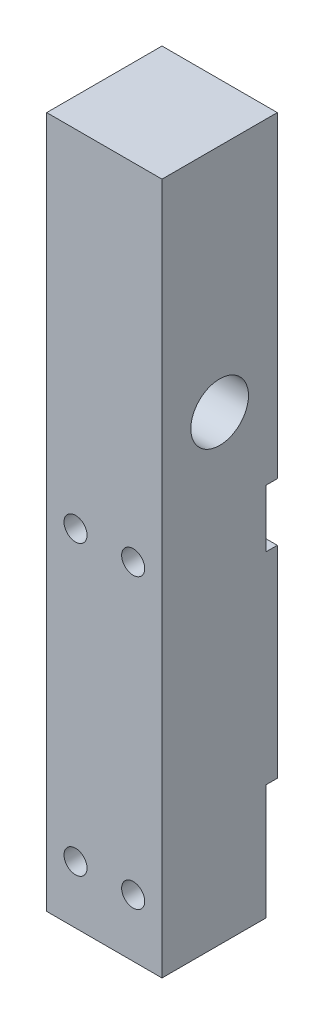
ISO-10303-21;
HEADER;
FILE_DESCRIPTION(('STEP AP214'),'2;1');
FILE_NAME('part.step','',(''),(''),'','','');
FILE_SCHEMA(('AUTOMOTIVE_DESIGN { 1 0 10303 214 1 1 1 1 }'));
ENDSEC;
DATA;
#1=APPLICATION_CONTEXT('core data for automotive mechanical design processes');
#2=APPLICATION_PROTOCOL_DEFINITION('international standard','automotive_design',2000,#1);
#3=PRODUCT_CONTEXT('',#1,'mechanical');
#4=PRODUCT('Part','Part','',(#3));
#5=PRODUCT_RELATED_PRODUCT_CATEGORY('part','',(#4));
#6=PRODUCT_DEFINITION_FORMATION('','',#4);
#7=PRODUCT_DEFINITION_CONTEXT('part definition',#1,'design');
#8=PRODUCT_DEFINITION('design','',#6,#7);
#9=PRODUCT_DEFINITION_SHAPE('','',#8);
#10=(LENGTH_UNIT() NAMED_UNIT(*) SI_UNIT(.MILLI.,.METRE.));
#11=(NAMED_UNIT(*) PLANE_ANGLE_UNIT() SI_UNIT($,.RADIAN.));
#12=(NAMED_UNIT(*) SI_UNIT($,.STERADIAN.) SOLID_ANGLE_UNIT());
#13=UNCERTAINTY_MEASURE_WITH_UNIT(LENGTH_MEASURE(1.E-05),#10,'distance_accuracy_value','');
#14=(GEOMETRIC_REPRESENTATION_CONTEXT(3) GLOBAL_UNCERTAINTY_ASSIGNED_CONTEXT((#13)) GLOBAL_UNIT_ASSIGNED_CONTEXT((#10,
#11,#12)) REPRESENTATION_CONTEXT('',''));
#15=CARTESIAN_POINT('',(0.,0.,0.));
#16=DIRECTION('',(0.,0.,1.));
#17=DIRECTION('',(1.,0.,0.));
#18=AXIS2_PLACEMENT_3D('',#15,#16,#17);
#19=CARTESIAN_POINT('',(-20.,120.,-20.));
#20=DIRECTION('',(0.,0.,-1.));
#21=DIRECTION('',(0.,1.,0.));
#22=AXIS2_PLACEMENT_3D('',#19,#20,#21);
#23=PLANE('',#22);
#24=DIRECTION('',(-1.,0.,0.));
#25=VECTOR('',#24,1.);
#26=CARTESIAN_POINT('',(0.,55.,-20.));
#27=LINE('',#26,#25);
#28=CARTESIAN_POINT('',(0.,55.,-20.));
#29=VERTEX_POINT('',#28);
#30=CARTESIAN_POINT('',(-20.,55.,-20.));
#31=VERTEX_POINT('',#30);
#32=EDGE_CURVE('E132',#29,#31,#27,.T.);
#33=ORIENTED_EDGE('',*,*,#32,.F.);
#34=DIRECTION('',(0.,1.,0.));
#35=VECTOR('',#34,1.);
#36=CARTESIAN_POINT('',(0.,120.,-20.));
#37=LINE('',#36,#35);
#38=CARTESIAN_POINT('',(0.,20.,-20.));
#39=VERTEX_POINT('',#38);
#40=EDGE_CURVE('E227',#39,#29,#37,.T.);
#41=ORIENTED_EDGE('',*,*,#40,.F.);
#42=DIRECTION('',(1.,0.,0.));
#43=VECTOR('',#42,1.);
#44=CARTESIAN_POINT('',(0.,20.,-20.));
#45=LINE('',#44,#43);
#46=CARTESIAN_POINT('',(-20.,20.,-20.));
#47=VERTEX_POINT('',#46);
#48=EDGE_CURVE('E146',#47,#39,#45,.T.);
#49=ORIENTED_EDGE('',*,*,#48,.F.);
#50=DIRECTION('',(0.,1.,0.));
#51=VECTOR('',#50,1.);
#52=CARTESIAN_POINT('',(-20.,120.,-20.));
#53=LINE('',#52,#51);
#54=EDGE_CURVE('E215',#47,#31,#53,.T.);
#55=ORIENTED_EDGE('',*,*,#54,.T.);
#56=EDGE_LOOP('',(#33,#41,#49,#55));
#57=FACE_BOUND('',#56,.T.);
#58=ADVANCED_FACE('F38',(#57),#23,.T.);
#59=CARTESIAN_POINT('',(-5.,9.99999999999999,-20.));
#60=DIRECTION('',(0.,0.,1.));
#61=DIRECTION('',(1.,0.,0.));
#62=AXIS2_PLACEMENT_3D('',#59,#60,#61);
#63=CYLINDRICAL_SURFACE('',#62,1.);
#64=CARTESIAN_POINT('',(-5.,9.99999999999999,-5.));
#65=DIRECTION('',(0.,0.,1.));
#66=DIRECTION('',(1.,0.,0.));
#67=AXIS2_PLACEMENT_3D('',#64,#65,#66);
#68=CIRCLE('',#67,1.);
#69=CARTESIAN_POINT('',(-4.,9.99999999999999,-5.));
#70=VERTEX_POINT('',#69);
#71=EDGE_CURVE('E202',#70,#70,#68,.T.);
#72=ORIENTED_EDGE('',*,*,#71,.T.);
#73=EDGE_LOOP('',(#72));
#74=FACE_BOUND('',#73,.T.);
#75=CARTESIAN_POINT('',(-5.,9.99999999999999,-18.));
#76=DIRECTION('',(0.,0.,-1.));
#77=DIRECTION('',(-1.,0.,0.));
#78=AXIS2_PLACEMENT_3D('',#75,#76,#77);
#79=CIRCLE('',#78,1.);
#80=CARTESIAN_POINT('',(-6.,9.99999999999999,-18.));
#81=VERTEX_POINT('',#80);
#82=EDGE_CURVE('E165',#81,#81,#79,.T.);
#83=ORIENTED_EDGE('',*,*,#82,.T.);
#84=EDGE_LOOP('',(#83));
#85=FACE_BOUND('',#84,.T.);
#86=ADVANCED_FACE('F303',(#74,#85),#63,.F.);
#87=CARTESIAN_POINT('',(-15.,9.99999999999999,-20.));
#88=DIRECTION('',(0.,0.,1.));
#89=DIRECTION('',(1.,0.,0.));
#90=AXIS2_PLACEMENT_3D('',#87,#88,#89);
#91=CYLINDRICAL_SURFACE('',#90,1.);
#92=CARTESIAN_POINT('',(-15.,9.99999999999999,-5.));
#93=DIRECTION('',(0.,0.,1.));
#94=DIRECTION('',(1.,0.,0.));
#95=AXIS2_PLACEMENT_3D('',#92,#93,#94);
#96=CIRCLE('',#95,1.);
#97=CARTESIAN_POINT('',(-14.,9.99999999999999,-5.));
#98=VERTEX_POINT('',#97);
#99=EDGE_CURVE('E192',#98,#98,#96,.F.);
#100=ORIENTED_EDGE('',*,*,#99,.F.);
#101=EDGE_LOOP('',(#100));
#102=FACE_BOUND('',#101,.T.);
#103=CARTESIAN_POINT('',(-15.,9.99999999999999,-18.));
#104=DIRECTION('',(0.,0.,-1.));
#105=DIRECTION('',(-1.,0.,0.));
#106=AXIS2_PLACEMENT_3D('',#103,#104,#105);
#107=CIRCLE('',#106,1.);
#108=CARTESIAN_POINT('',(-16.,9.99999999999999,-18.));
#109=VERTEX_POINT('',#108);
#110=EDGE_CURVE('E162',#109,#109,#107,.F.);
#111=ORIENTED_EDGE('',*,*,#110,.F.);
#112=EDGE_LOOP('',(#111));
#113=FACE_BOUND('',#112,.T.);
#114=ADVANCED_FACE('F307',(#102,#113),#91,.F.);
#115=CARTESIAN_POINT('',(-20.,0.,0.));
#116=DIRECTION('',(0.,-1.,0.));
#117=DIRECTION('',(0.,0.,-1.));
#118=AXIS2_PLACEMENT_3D('',#115,#116,#117);
#119=PLANE('',#118);
#120=DIRECTION('',(0.,0.,-1.));
#121=VECTOR('',#120,1.);
#122=CARTESIAN_POINT('',(-20.,0.,0.));
#123=LINE('',#122,#121);
#124=CARTESIAN_POINT('',(-20.,0.,0.));
#125=VERTEX_POINT('',#124);
#126=CARTESIAN_POINT('',(-20.,0.,-18.));
#127=VERTEX_POINT('',#126);
#128=EDGE_CURVE('E210',#125,#127,#123,.T.);
#129=ORIENTED_EDGE('',*,*,#128,.T.);
#130=DIRECTION('',(-1.,0.,0.));
#131=VECTOR('',#130,1.);
#132=CARTESIAN_POINT('',(0.,0.,-18.));
#133=LINE('',#132,#131);
#134=CARTESIAN_POINT('',(0.,0.,-18.));
#135=VERTEX_POINT('',#134);
#136=EDGE_CURVE('E150',#135,#127,#133,.T.);
#137=ORIENTED_EDGE('',*,*,#136,.F.);
#138=DIRECTION('',(0.,0.,-1.));
#139=VECTOR('',#138,1.);
#140=CARTESIAN_POINT('',(0.,0.,0.));
#141=LINE('',#140,#139);
#142=CARTESIAN_POINT('',(0.,0.,0.));
#143=VERTEX_POINT('',#142);
#144=EDGE_CURVE('E222',#143,#135,#141,.T.);
#145=ORIENTED_EDGE('',*,*,#144,.F.);
#146=DIRECTION('',(1.,0.,0.));
#147=VECTOR('',#146,1.);
#148=CARTESIAN_POINT('',(-20.,0.,0.));
#149=LINE('',#148,#147);
#150=EDGE_CURVE('E219',#125,#143,#149,.T.);
#151=ORIENTED_EDGE('',*,*,#150,.F.);
#152=EDGE_LOOP('',(#129,#137,#145,#151));
#153=FACE_BOUND('',#152,.T.);
#154=ADVANCED_FACE('F284',(#153),#119,.T.);
#155=CARTESIAN_POINT('',(-15.,60.,-20.));
#156=DIRECTION('',(0.,0.,1.));
#157=DIRECTION('',(1.,0.,0.));
#158=AXIS2_PLACEMENT_3D('',#155,#156,#157);
#159=CYLINDRICAL_SURFACE('',#158,1.);
#160=CARTESIAN_POINT('',(-15.,60.,-5.));
#161=DIRECTION('',(0.,0.,1.));
#162=DIRECTION('',(1.,0.,0.));
#163=AXIS2_PLACEMENT_3D('',#160,#161,#162);
#164=CIRCLE('',#163,1.);
#165=CARTESIAN_POINT('',(-14.,60.,-5.));
#166=VERTEX_POINT('',#165);
#167=EDGE_CURVE('E168',#166,#166,#164,.T.);
#168=ORIENTED_EDGE('',*,*,#167,.T.);
#169=EDGE_LOOP('',(#168));
#170=FACE_BOUND('',#169,.T.);
#171=CARTESIAN_POINT('',(-15.,60.,-18.));
#172=DIRECTION('',(0.,0.,-1.));
#173=DIRECTION('',(0.,1.,0.));
#174=AXIS2_PLACEMENT_3D('',#171,#172,#173);
#175=CIRCLE('',#174,1.);
#176=CARTESIAN_POINT('',(-15.,61.,-18.));
#177=VERTEX_POINT('',#176);
#178=EDGE_CURVE('E159',#177,#177,#175,.F.);
#179=ORIENTED_EDGE('',*,*,#178,.F.);
#180=EDGE_LOOP('',(#179));
#181=FACE_BOUND('',#180,.T.);
#182=ADVANCED_FACE('F250',(#170,#181),#159,.F.);
#183=CARTESIAN_POINT('',(-4.99999999999999,60.,-20.));
#184=DIRECTION('',(0.,0.,1.));
#185=DIRECTION('',(1.,0.,0.));
#186=AXIS2_PLACEMENT_3D('',#183,#184,#185);
#187=CYLINDRICAL_SURFACE('',#186,1.);
#188=CARTESIAN_POINT('',(-4.99999999999999,60.,-5.));
#189=DIRECTION('',(0.,0.,1.));
#190=DIRECTION('',(1.,0.,0.));
#191=AXIS2_PLACEMENT_3D('',#188,#189,#190);
#192=CIRCLE('',#191,1.);
#193=CARTESIAN_POINT('',(-3.99999999999999,60.,-5.));
#194=VERTEX_POINT('',#193);
#195=EDGE_CURVE('E176',#194,#194,#192,.F.);
#196=ORIENTED_EDGE('',*,*,#195,.F.);
#197=EDGE_LOOP('',(#196));
#198=FACE_BOUND('',#197,.T.);
#199=CARTESIAN_POINT('',(-4.99999999999999,60.,-18.));
#200=DIRECTION('',(0.,0.,-1.));
#201=DIRECTION('',(0.,1.,0.));
#202=AXIS2_PLACEMENT_3D('',#199,#200,#201);
#203=CIRCLE('',#202,1.);
#204=CARTESIAN_POINT('',(-4.99999999999999,61.,-18.));
#205=VERTEX_POINT('',#204);
#206=EDGE_CURVE('E42',#205,#205,#203,.T.);
#207=ORIENTED_EDGE('',*,*,#206,.T.);
#208=EDGE_LOOP('',(#207));
#209=FACE_BOUND('',#208,.T.);
#210=ADVANCED_FACE('F246',(#198,#209),#187,.F.);
#211=DIRECTION('',(1.,0.,0.));
#212=VECTOR('',#211,1.);
#213=CARTESIAN_POINT('',(0.,65.,-20.));
#214=LINE('',#213,#212);
#215=CARTESIAN_POINT('',(-20.,65.,-20.));
#216=VERTEX_POINT('',#215);
#217=CARTESIAN_POINT('',(0.,65.,-20.));
#218=VERTEX_POINT('',#217);
#219=EDGE_CURVE('E157',#216,#218,#214,.T.);
#220=ORIENTED_EDGE('',*,*,#219,.F.);
#221=CARTESIAN_POINT('',(-20.,120.,-20.));
#222=VERTEX_POINT('',#221);
#223=EDGE_CURVE('E137',#216,#222,#53,.T.);
#224=ORIENTED_EDGE('',*,*,#223,.T.);
#225=DIRECTION('',(1.,0.,0.));
#226=VECTOR('',#225,1.);
#227=CARTESIAN_POINT('',(-20.,120.,-20.));
#228=LINE('',#227,#226);
#229=CARTESIAN_POINT('',(0.,120.,-20.));
#230=VERTEX_POINT('',#229);
#231=EDGE_CURVE('E47',#222,#230,#228,.T.);
#232=ORIENTED_EDGE('',*,*,#231,.T.);
#233=EDGE_CURVE('E225',#218,#230,#37,.T.);
#234=ORIENTED_EDGE('',*,*,#233,.F.);
#235=EDGE_LOOP('',(#220,#224,#232,#234));
#236=FACE_BOUND('',#235,.T.);
#237=ADVANCED_FACE('F249',(#236),#23,.T.);
#238=CARTESIAN_POINT('',(-20.,120.,0.));
#239=DIRECTION('',(0.,0.,1.));
#240=DIRECTION('',(0.,-1.,0.));
#241=AXIS2_PLACEMENT_3D('',#238,#239,#240);
#242=PLANE('',#241);
#243=CARTESIAN_POINT('',(-5.,9.99999999999999,0.));
#244=DIRECTION('',(0.,0.,1.));
#245=DIRECTION('',(1.,0.,0.));
#246=AXIS2_PLACEMENT_3D('',#243,#244,#245);
#247=CIRCLE('',#246,2.);
#248=CARTESIAN_POINT('',(-3.,9.99999999999999,0.));
#249=VERTEX_POINT('',#248);
#250=EDGE_CURVE('E181',#249,#249,#247,.T.);
#251=ORIENTED_EDGE('',*,*,#250,.F.);
#252=EDGE_LOOP('',(#251));
#253=FACE_BOUND('',#252,.T.);
#254=CARTESIAN_POINT('',(-15.,60.,0.));
#255=DIRECTION('',(0.,0.,1.));
#256=DIRECTION('',(1.,0.,0.));
#257=AXIS2_PLACEMENT_3D('',#254,#255,#256);
#258=CIRCLE('',#257,2.);
#259=CARTESIAN_POINT('',(-13.,60.,0.));
#260=VERTEX_POINT('',#259);
#261=EDGE_CURVE('E172',#260,#260,#258,.T.);
#262=ORIENTED_EDGE('',*,*,#261,.F.);
#263=EDGE_LOOP('',(#262));
#264=FACE_BOUND('',#263,.T.);
#265=CARTESIAN_POINT('',(-5.,60.,0.));
#266=DIRECTION('',(0.,0.,1.));
#267=DIRECTION('',(1.,0.,0.));
#268=AXIS2_PLACEMENT_3D('',#265,#266,#267);
#269=CIRCLE('',#268,2.);
#270=CARTESIAN_POINT('',(-3.,60.,0.));
#271=VERTEX_POINT('',#270);
#272=EDGE_CURVE('E173',#271,#271,#269,.T.);
#273=ORIENTED_EDGE('',*,*,#272,.F.);
#274=EDGE_LOOP('',(#273));
#275=FACE_BOUND('',#274,.T.);
#276=CARTESIAN_POINT('',(-15.,9.99999999999999,0.));
#277=DIRECTION('',(0.,0.,1.));
#278=DIRECTION('',(1.,0.,0.));
#279=AXIS2_PLACEMENT_3D('',#276,#277,#278);
#280=CIRCLE('',#279,2.);
#281=CARTESIAN_POINT('',(-13.,9.99999999999999,0.));
#282=VERTEX_POINT('',#281);
#283=EDGE_CURVE('E180',#282,#282,#280,.T.);
#284=ORIENTED_EDGE('',*,*,#283,.F.);
#285=EDGE_LOOP('',(#284));
#286=FACE_BOUND('',#285,.T.);
#287=DIRECTION('',(0.,-1.,0.));
#288=VECTOR('',#287,1.);
#289=CARTESIAN_POINT('',(0.,120.,0.));
#290=LINE('',#289,#288);
#291=CARTESIAN_POINT('',(0.,120.,0.));
#292=VERTEX_POINT('',#291);
#293=EDGE_CURVE('E206',#292,#143,#290,.T.);
#294=ORIENTED_EDGE('',*,*,#293,.F.);
#295=DIRECTION('',(1.,0.,0.));
#296=VECTOR('',#295,1.);
#297=CARTESIAN_POINT('',(-20.,120.,0.));
#298=LINE('',#297,#296);
#299=CARTESIAN_POINT('',(-20.,120.,0.));
#300=VERTEX_POINT('',#299);
#301=EDGE_CURVE('E12',#300,#292,#298,.T.);
#302=ORIENTED_EDGE('',*,*,#301,.F.);
#303=DIRECTION('',(0.,-1.,0.));
#304=VECTOR('',#303,1.);
#305=CARTESIAN_POINT('',(-20.,120.,0.));
#306=LINE('',#305,#304);
#307=EDGE_CURVE('E207',#300,#125,#306,.T.);
#308=ORIENTED_EDGE('',*,*,#307,.T.);
#309=ORIENTED_EDGE('',*,*,#150,.T.);
#310=EDGE_LOOP('',(#294,#302,#308,#309));
#311=FACE_BOUND('',#310,.T.);
#312=ADVANCED_FACE('F40',(#253,#264,#275,#286,#311),#242,.T.);
#313=CARTESIAN_POINT('',(-20.,80.,-10.));
#314=DIRECTION('',(1.,0.,0.));
#315=DIRECTION('',(0.,0.,-1.));
#316=AXIS2_PLACEMENT_3D('',#313,#314,#315);
#317=CYLINDRICAL_SURFACE('',#316,2.5);
#318=CARTESIAN_POINT('',(-20.,80.,-10.));
#319=DIRECTION('',(1.,0.,0.));
#320=DIRECTION('',(0.,0.,-1.));
#321=AXIS2_PLACEMENT_3D('',#318,#319,#320);
#322=CIRCLE('',#321,2.5);
#323=CARTESIAN_POINT('',(-20.,80.,-12.5));
#324=VERTEX_POINT('',#323);
#325=EDGE_CURVE('E203',#324,#324,#322,.T.);
#326=ORIENTED_EDGE('',*,*,#325,.F.);
#327=EDGE_LOOP('',(#326));
#328=FACE_BOUND('',#327,.T.);
#329=CARTESIAN_POINT('',(-10.,80.,-10.));
#330=DIRECTION('',(1.,0.,0.));
#331=DIRECTION('',(0.,0.,-1.));
#332=AXIS2_PLACEMENT_3D('',#329,#330,#331);
#333=CIRCLE('',#332,2.5);
#334=CARTESIAN_POINT('',(-10.,80.,-12.5));
#335=VERTEX_POINT('',#334);
#336=EDGE_CURVE('E198',#335,#335,#333,.F.);
#337=ORIENTED_EDGE('',*,*,#336,.F.);
#338=EDGE_LOOP('',(#337));
#339=FACE_BOUND('',#338,.T.);
#340=ADVANCED_FACE('F299',(#328,#339),#317,.F.);
#341=CARTESIAN_POINT('',(-20.,120.,0.));
#342=DIRECTION('',(0.,1.,0.));
#343=DIRECTION('',(0.,0.,1.));
#344=AXIS2_PLACEMENT_3D('',#341,#342,#343);
#345=PLANE('',#344);
#346=DIRECTION('',(0.,0.,1.));
#347=VECTOR('',#346,1.);
#348=CARTESIAN_POINT('',(0.,120.,0.));
#349=LINE('',#348,#347);
#350=EDGE_CURVE('E211',#230,#292,#349,.T.);
#351=ORIENTED_EDGE('',*,*,#350,.F.);
#352=ORIENTED_EDGE('',*,*,#231,.F.);
#353=DIRECTION('',(0.,0.,1.));
#354=VECTOR('',#353,1.);
#355=CARTESIAN_POINT('',(-20.,120.,0.));
#356=LINE('',#355,#354);
#357=EDGE_CURVE('E216',#222,#300,#356,.T.);
#358=ORIENTED_EDGE('',*,*,#357,.T.);
#359=ORIENTED_EDGE('',*,*,#301,.T.);
#360=EDGE_LOOP('',(#351,#352,#358,#359));
#361=FACE_BOUND('',#360,.T.);
#362=ADVANCED_FACE('F291',(#361),#345,.T.);
#363=CARTESIAN_POINT('',(-20.,0.,0.));
#364=DIRECTION('',(1.,0.,0.));
#365=DIRECTION('',(0.,0.,-1.));
#366=AXIS2_PLACEMENT_3D('',#363,#364,#365);
#367=PLANE('',#366);
#368=ORIENTED_EDGE('',*,*,#325,.T.);
#369=EDGE_LOOP('',(#368));
#370=FACE_BOUND('',#369,.T.);
#371=DIRECTION('',(0.,1.,0.));
#372=VECTOR('',#371,1.);
#373=CARTESIAN_POINT('',(-20.,65.,-18.));
#374=LINE('',#373,#372);
#375=CARTESIAN_POINT('',(-20.,55.,-18.));
#376=VERTEX_POINT('',#375);
#377=CARTESIAN_POINT('',(-20.,65.,-18.));
#378=VERTEX_POINT('',#377);
#379=EDGE_CURVE('E122',#376,#378,#374,.T.);
#380=ORIENTED_EDGE('',*,*,#379,.F.);
#381=DIRECTION('',(0.,0.,-1.));
#382=VECTOR('',#381,1.);
#383=CARTESIAN_POINT('',(-20.,55.,-18.));
#384=LINE('',#383,#382);
#385=EDGE_CURVE('E255',#376,#31,#384,.T.);
#386=ORIENTED_EDGE('',*,*,#385,.T.);
#387=ORIENTED_EDGE('',*,*,#54,.F.);
#388=DIRECTION('',(0.,0.,-1.));
#389=VECTOR('',#388,1.);
#390=CARTESIAN_POINT('',(-20.,20.,-18.));
#391=LINE('',#390,#389);
#392=CARTESIAN_POINT('',(-20.,20.,-18.));
#393=VERTEX_POINT('',#392);
#394=EDGE_CURVE('E152',#393,#47,#391,.T.);
#395=ORIENTED_EDGE('',*,*,#394,.F.);
#396=DIRECTION('',(0.,1.,0.));
#397=VECTOR('',#396,1.);
#398=CARTESIAN_POINT('',(-20.,20.,-18.));
#399=LINE('',#398,#397);
#400=EDGE_CURVE('E144',#127,#393,#399,.T.);
#401=ORIENTED_EDGE('',*,*,#400,.F.);
#402=ORIENTED_EDGE('',*,*,#128,.F.);
#403=ORIENTED_EDGE('',*,*,#307,.F.);
#404=ORIENTED_EDGE('',*,*,#357,.F.);
#405=ORIENTED_EDGE('',*,*,#223,.F.);
#406=DIRECTION('',(0.,0.,-1.));
#407=VECTOR('',#406,1.);
#408=CARTESIAN_POINT('',(-20.,65.,-18.));
#409=LINE('',#408,#407);
#410=EDGE_CURVE('E116',#378,#216,#409,.T.);
#411=ORIENTED_EDGE('',*,*,#410,.F.);
#412=EDGE_LOOP('',(#380,#386,#387,#395,#401,#402,#403,#404,#405,#411));
#413=FACE_BOUND('',#412,.T.);
#414=ADVANCED_FACE('F135',(#370,#413),#367,.F.);
#415=CARTESIAN_POINT('',(0.,0.,0.));
#416=DIRECTION('',(1.,0.,0.));
#417=DIRECTION('',(0.,0.,-1.));
#418=AXIS2_PLACEMENT_3D('',#415,#416,#417);
#419=PLANE('',#418);
#420=DIRECTION('',(0.,0.,-1.));
#421=VECTOR('',#420,1.);
#422=CARTESIAN_POINT('',(0.,55.,-18.));
#423=LINE('',#422,#421);
#424=CARTESIAN_POINT('',(0.,55.,-18.));
#425=VERTEX_POINT('',#424);
#426=EDGE_CURVE('E139',#425,#29,#423,.T.);
#427=ORIENTED_EDGE('',*,*,#426,.F.);
#428=DIRECTION('',(0.,-1.,0.));
#429=VECTOR('',#428,1.);
#430=CARTESIAN_POINT('',(0.,65.,-18.));
#431=LINE('',#430,#429);
#432=CARTESIAN_POINT('',(0.,65.,-18.));
#433=VERTEX_POINT('',#432);
#434=EDGE_CURVE('E121',#433,#425,#431,.T.);
#435=ORIENTED_EDGE('',*,*,#434,.F.);
#436=DIRECTION('',(0.,0.,-1.));
#437=VECTOR('',#436,1.);
#438=CARTESIAN_POINT('',(0.,65.,-18.));
#439=LINE('',#438,#437);
#440=EDGE_CURVE('E119',#433,#218,#439,.T.);
#441=ORIENTED_EDGE('',*,*,#440,.T.);
#442=ORIENTED_EDGE('',*,*,#233,.T.);
#443=ORIENTED_EDGE('',*,*,#350,.T.);
#444=ORIENTED_EDGE('',*,*,#293,.T.);
#445=ORIENTED_EDGE('',*,*,#144,.T.);
#446=DIRECTION('',(0.,-1.,0.));
#447=VECTOR('',#446,1.);
#448=CARTESIAN_POINT('',(0.,20.,-18.));
#449=LINE('',#448,#447);
#450=CARTESIAN_POINT('',(0.,20.,-18.));
#451=VERTEX_POINT('',#450);
#452=EDGE_CURVE('E148',#451,#135,#449,.T.);
#453=ORIENTED_EDGE('',*,*,#452,.F.);
#454=DIRECTION('',(0.,0.,-1.));
#455=VECTOR('',#454,1.);
#456=CARTESIAN_POINT('',(0.,20.,-18.));
#457=LINE('',#456,#455);
#458=EDGE_CURVE('E154',#451,#39,#457,.T.);
#459=ORIENTED_EDGE('',*,*,#458,.T.);
#460=ORIENTED_EDGE('',*,*,#40,.T.);
#461=EDGE_LOOP('',(#427,#435,#441,#442,#443,#444,#445,#453,#459,#460));
#462=FACE_BOUND('',#461,.T.);
#463=CARTESIAN_POINT('',(0.,80.,-10.));
#464=DIRECTION('',(1.,0.,0.));
#465=DIRECTION('',(0.,0.,-1.));
#466=AXIS2_PLACEMENT_3D('',#463,#464,#465);
#467=CIRCLE('',#466,5.);
#468=CARTESIAN_POINT('',(0.,80.,-15.));
#469=VERTEX_POINT('',#468);
#470=EDGE_CURVE('E199',#469,#469,#467,.T.);
#471=ORIENTED_EDGE('',*,*,#470,.F.);
#472=EDGE_LOOP('',(#471));
#473=FACE_BOUND('',#472,.T.);
#474=ADVANCED_FACE('F268',(#462,#473),#419,.T.);
#475=CARTESIAN_POINT('',(-10.,80.,-10.));
#476=DIRECTION('',(1.,0.,0.));
#477=DIRECTION('',(0.,0.,-1.));
#478=AXIS2_PLACEMENT_3D('',#475,#476,#477);
#479=PLANE('',#478);
#480=CARTESIAN_POINT('',(-10.,80.,-10.));
#481=DIRECTION('',(1.,0.,0.));
#482=DIRECTION('',(0.,0.,-1.));
#483=AXIS2_PLACEMENT_3D('',#480,#481,#482);
#484=CIRCLE('',#483,5.);
#485=CARTESIAN_POINT('',(-10.,80.,-15.));
#486=VERTEX_POINT('',#485);
#487=EDGE_CURVE('E195',#486,#486,#484,.T.);
#488=ORIENTED_EDGE('',*,*,#487,.T.);
#489=EDGE_LOOP('',(#488));
#490=FACE_BOUND('',#489,.T.);
#491=ORIENTED_EDGE('',*,*,#336,.T.);
#492=EDGE_LOOP('',(#491));
#493=FACE_BOUND('',#492,.T.);
#494=ADVANCED_FACE('F318',(#490,#493),#479,.T.);
#495=CARTESIAN_POINT('',(-10.,80.,-10.));
#496=DIRECTION('',(1.,0.,0.));
#497=DIRECTION('',(0.,0.,-1.));
#498=AXIS2_PLACEMENT_3D('',#495,#496,#497);
#499=CYLINDRICAL_SURFACE('',#498,5.);
#500=ORIENTED_EDGE('',*,*,#487,.F.);
#501=EDGE_LOOP('',(#500));
#502=FACE_BOUND('',#501,.T.);
#503=ORIENTED_EDGE('',*,*,#470,.T.);
#504=EDGE_LOOP('',(#503));
#505=FACE_BOUND('',#504,.T.);
#506=ADVANCED_FACE('F321',(#502,#505),#499,.F.);
#507=CARTESIAN_POINT('',(-15.,9.99999999999999,-5.));
#508=DIRECTION('',(0.,0.,1.));
#509=DIRECTION('',(1.,0.,0.));
#510=AXIS2_PLACEMENT_3D('',#507,#508,#509);
#511=PLANE('',#510);
#512=CARTESIAN_POINT('',(-15.,9.99999999999999,-5.));
#513=DIRECTION('',(0.,0.,1.));
#514=DIRECTION('',(1.,0.,0.));
#515=AXIS2_PLACEMENT_3D('',#512,#513,#514);
#516=CIRCLE('',#515,2.);
#517=CARTESIAN_POINT('',(-13.,9.99999999999999,-5.));
#518=VERTEX_POINT('',#517);
#519=EDGE_CURVE('E189',#518,#518,#516,.T.);
#520=ORIENTED_EDGE('',*,*,#519,.T.);
#521=EDGE_LOOP('',(#520));
#522=FACE_BOUND('',#521,.T.);
#523=ORIENTED_EDGE('',*,*,#99,.T.);
#524=EDGE_LOOP('',(#523));
#525=FACE_BOUND('',#524,.T.);
#526=ADVANCED_FACE('F325',(#522,#525),#511,.T.);
#527=CARTESIAN_POINT('',(-15.,9.99999999999999,-5.));
#528=DIRECTION('',(0.,0.,1.));
#529=DIRECTION('',(1.,0.,0.));
#530=AXIS2_PLACEMENT_3D('',#527,#528,#529);
#531=CYLINDRICAL_SURFACE('',#530,2.);
#532=ORIENTED_EDGE('',*,*,#519,.F.);
#533=EDGE_LOOP('',(#532));
#534=FACE_BOUND('',#533,.T.);
#535=ORIENTED_EDGE('',*,*,#283,.T.);
#536=EDGE_LOOP('',(#535));
#537=FACE_BOUND('',#536,.T.);
#538=ADVANCED_FACE('F363',(#534,#537),#531,.F.);
#539=CARTESIAN_POINT('',(-5.,9.99999999999999,-5.));
#540=DIRECTION('',(0.,0.,1.));
#541=DIRECTION('',(1.,0.,0.));
#542=AXIS2_PLACEMENT_3D('',#539,#540,#541);
#543=CYLINDRICAL_SURFACE('',#542,2.);
#544=CARTESIAN_POINT('',(-5.,9.99999999999999,-5.));
#545=DIRECTION('',(0.,0.,1.));
#546=DIRECTION('',(1.,0.,0.));
#547=AXIS2_PLACEMENT_3D('',#544,#545,#546);
#548=CIRCLE('',#547,2.);
#549=CARTESIAN_POINT('',(-3.,9.99999999999999,-5.));
#550=VERTEX_POINT('',#549);
#551=EDGE_CURVE('E177',#550,#550,#548,.T.);
#552=ORIENTED_EDGE('',*,*,#551,.F.);
#553=EDGE_LOOP('',(#552));
#554=FACE_BOUND('',#553,.T.);
#555=ORIENTED_EDGE('',*,*,#250,.T.);
#556=EDGE_LOOP('',(#555));
#557=FACE_BOUND('',#556,.T.);
#558=ADVANCED_FACE('F371',(#554,#557),#543,.F.);
#559=CARTESIAN_POINT('',(-5.,9.99999999999999,-5.));
#560=DIRECTION('',(0.,0.,1.));
#561=DIRECTION('',(1.,0.,0.));
#562=AXIS2_PLACEMENT_3D('',#559,#560,#561);
#563=PLANE('',#562);
#564=ORIENTED_EDGE('',*,*,#71,.F.);
#565=EDGE_LOOP('',(#564));
#566=FACE_BOUND('',#565,.T.);
#567=ORIENTED_EDGE('',*,*,#551,.T.);
#568=EDGE_LOOP('',(#567));
#569=FACE_BOUND('',#568,.T.);
#570=ADVANCED_FACE('F378',(#566,#569),#563,.T.);
#571=CARTESIAN_POINT('',(-5.,60.,-5.));
#572=DIRECTION('',(0.,0.,1.));
#573=DIRECTION('',(1.,0.,0.));
#574=AXIS2_PLACEMENT_3D('',#571,#572,#573);
#575=CYLINDRICAL_SURFACE('',#574,2.);
#576=CARTESIAN_POINT('',(-5.,60.,-5.));
#577=DIRECTION('',(0.,0.,1.));
#578=DIRECTION('',(1.,0.,0.));
#579=AXIS2_PLACEMENT_3D('',#576,#577,#578);
#580=CIRCLE('',#579,2.);
#581=CARTESIAN_POINT('',(-3.,60.,-5.));
#582=VERTEX_POINT('',#581);
#583=EDGE_CURVE('E169',#582,#582,#580,.T.);
#584=ORIENTED_EDGE('',*,*,#583,.F.);
#585=EDGE_LOOP('',(#584));
#586=FACE_BOUND('',#585,.T.);
#587=ORIENTED_EDGE('',*,*,#272,.T.);
#588=EDGE_LOOP('',(#587));
#589=FACE_BOUND('',#588,.T.);
#590=ADVANCED_FACE('F386',(#586,#589),#575,.F.);
#591=CARTESIAN_POINT('',(-5.,60.,-5.));
#592=DIRECTION('',(0.,0.,1.));
#593=DIRECTION('',(1.,0.,0.));
#594=AXIS2_PLACEMENT_3D('',#591,#592,#593);
#595=PLANE('',#594);
#596=ORIENTED_EDGE('',*,*,#195,.T.);
#597=EDGE_LOOP('',(#596));
#598=FACE_BOUND('',#597,.T.);
#599=ORIENTED_EDGE('',*,*,#583,.T.);
#600=EDGE_LOOP('',(#599));
#601=FACE_BOUND('',#600,.T.);
#602=ADVANCED_FACE('F243',(#598,#601),#595,.T.);
#603=CARTESIAN_POINT('',(-15.,60.,-5.));
#604=DIRECTION('',(0.,0.,1.));
#605=DIRECTION('',(1.,0.,0.));
#606=AXIS2_PLACEMENT_3D('',#603,#604,#605);
#607=CYLINDRICAL_SURFACE('',#606,2.);
#608=CARTESIAN_POINT('',(-15.,60.,-5.));
#609=DIRECTION('',(0.,0.,1.));
#610=DIRECTION('',(1.,0.,0.));
#611=AXIS2_PLACEMENT_3D('',#608,#609,#610);
#612=CIRCLE('',#611,2.);
#613=CARTESIAN_POINT('',(-13.,60.,-5.));
#614=VERTEX_POINT('',#613);
#615=EDGE_CURVE('E184',#614,#614,#612,.T.);
#616=ORIENTED_EDGE('',*,*,#615,.F.);
#617=EDGE_LOOP('',(#616));
#618=FACE_BOUND('',#617,.T.);
#619=ORIENTED_EDGE('',*,*,#261,.T.);
#620=EDGE_LOOP('',(#619));
#621=FACE_BOUND('',#620,.T.);
#622=ADVANCED_FACE('F402',(#618,#621),#607,.F.);
#623=CARTESIAN_POINT('',(-15.,60.,-5.));
#624=DIRECTION('',(0.,0.,1.));
#625=DIRECTION('',(1.,0.,0.));
#626=AXIS2_PLACEMENT_3D('',#623,#624,#625);
#627=PLANE('',#626);
#628=ORIENTED_EDGE('',*,*,#167,.F.);
#629=EDGE_LOOP('',(#628));
#630=FACE_BOUND('',#629,.T.);
#631=ORIENTED_EDGE('',*,*,#615,.T.);
#632=EDGE_LOOP('',(#631));
#633=FACE_BOUND('',#632,.T.);
#634=ADVANCED_FACE('F409',(#630,#633),#627,.T.);
#635=CARTESIAN_POINT('',(0.,0.,-18.));
#636=DIRECTION('',(0.,0.,-1.));
#637=DIRECTION('',(0.,1.,0.));
#638=AXIS2_PLACEMENT_3D('',#635,#636,#637);
#639=PLANE('',#638);
#640=ORIENTED_EDGE('',*,*,#206,.F.);
#641=EDGE_LOOP('',(#640));
#642=FACE_BOUND('',#641,.T.);
#643=ORIENTED_EDGE('',*,*,#379,.T.);
#644=DIRECTION('',(1.,0.,0.));
#645=VECTOR('',#644,1.);
#646=CARTESIAN_POINT('',(0.,65.,-18.));
#647=LINE('',#646,#645);
#648=EDGE_CURVE('E55',#378,#433,#647,.T.);
#649=ORIENTED_EDGE('',*,*,#648,.T.);
#650=ORIENTED_EDGE('',*,*,#434,.T.);
#651=DIRECTION('',(-1.,0.,0.));
#652=VECTOR('',#651,1.);
#653=CARTESIAN_POINT('',(0.,55.,-18.));
#654=LINE('',#653,#652);
#655=EDGE_CURVE('E129',#425,#376,#654,.T.);
#656=ORIENTED_EDGE('',*,*,#655,.T.);
#657=EDGE_LOOP('',(#643,#649,#650,#656));
#658=FACE_BOUND('',#657,.T.);
#659=ORIENTED_EDGE('',*,*,#178,.T.);
#660=EDGE_LOOP('',(#659));
#661=FACE_BOUND('',#660,.T.);
#662=ADVANCED_FACE('F126',(#642,#658,#661),#639,.T.);
#663=CARTESIAN_POINT('',(0.,55.,-18.));
#664=DIRECTION('',(0.,-1.,0.));
#665=DIRECTION('',(0.,0.,-1.));
#666=AXIS2_PLACEMENT_3D('',#663,#664,#665);
#667=PLANE('',#666);
#668=ORIENTED_EDGE('',*,*,#32,.T.);
#669=ORIENTED_EDGE('',*,*,#385,.F.);
#670=ORIENTED_EDGE('',*,*,#655,.F.);
#671=ORIENTED_EDGE('',*,*,#426,.T.);
#672=EDGE_LOOP('',(#668,#669,#670,#671));
#673=FACE_BOUND('',#672,.T.);
#674=ADVANCED_FACE('F265',(#673),#667,.F.);
#675=CARTESIAN_POINT('',(0.,65.,-18.));
#676=DIRECTION('',(0.,1.,0.));
#677=DIRECTION('',(-1.,0.,0.));
#678=AXIS2_PLACEMENT_3D('',#675,#676,#677);
#679=PLANE('',#678);
#680=ORIENTED_EDGE('',*,*,#219,.T.);
#681=ORIENTED_EDGE('',*,*,#440,.F.);
#682=ORIENTED_EDGE('',*,*,#648,.F.);
#683=ORIENTED_EDGE('',*,*,#410,.T.);
#684=EDGE_LOOP('',(#680,#681,#682,#683));
#685=FACE_BOUND('',#684,.T.);
#686=ADVANCED_FACE('F114',(#685),#679,.F.);
#687=CARTESIAN_POINT('',(0.,0.,-18.));
#688=DIRECTION('',(0.,0.,-1.));
#689=DIRECTION('',(-1.,0.,0.));
#690=AXIS2_PLACEMENT_3D('',#687,#688,#689);
#691=PLANE('',#690);
#692=ORIENTED_EDGE('',*,*,#82,.F.);
#693=EDGE_LOOP('',(#692));
#694=FACE_BOUND('',#693,.T.);
#695=ORIENTED_EDGE('',*,*,#400,.T.);
#696=DIRECTION('',(1.,0.,0.));
#697=VECTOR('',#696,1.);
#698=CARTESIAN_POINT('',(0.,20.,-18.));
#699=LINE('',#698,#697);
#700=EDGE_CURVE('E63',#393,#451,#699,.T.);
#701=ORIENTED_EDGE('',*,*,#700,.T.);
#702=ORIENTED_EDGE('',*,*,#452,.T.);
#703=ORIENTED_EDGE('',*,*,#136,.T.);
#704=EDGE_LOOP('',(#695,#701,#702,#703));
#705=FACE_BOUND('',#704,.T.);
#706=ORIENTED_EDGE('',*,*,#110,.T.);
#707=EDGE_LOOP('',(#706));
#708=FACE_BOUND('',#707,.T.);
#709=ADVANCED_FACE('F279',(#694,#705,#708),#691,.T.);
#710=CARTESIAN_POINT('',(0.,20.,-18.));
#711=DIRECTION('',(0.,1.,0.));
#712=DIRECTION('',(0.,0.,1.));
#713=AXIS2_PLACEMENT_3D('',#710,#711,#712);
#714=PLANE('',#713);
#715=ORIENTED_EDGE('',*,*,#48,.T.);
#716=ORIENTED_EDGE('',*,*,#458,.F.);
#717=ORIENTED_EDGE('',*,*,#700,.F.);
#718=ORIENTED_EDGE('',*,*,#394,.T.);
#719=EDGE_LOOP('',(#715,#716,#717,#718));
#720=FACE_BOUND('',#719,.T.);
#721=ADVANCED_FACE('F278',(#720),#714,.F.);
#722=CLOSED_SHELL('',(#58,#86,#114,#154,#182,#210,#237,#312,#340,#362,#414,#474,#494,#506,#526,
#538,#558,#570,#590,#602,#622,#634,#662,#674,#686,#709,#721));
#723=MANIFOLD_SOLID_BREP('B2',#722);
#724=ADVANCED_BREP_SHAPE_REPRESENTATION('',(#18,#723),#14);
#725=SHAPE_DEFINITION_REPRESENTATION(#9,#724);
ENDSEC;
END-ISO-10303-21;
